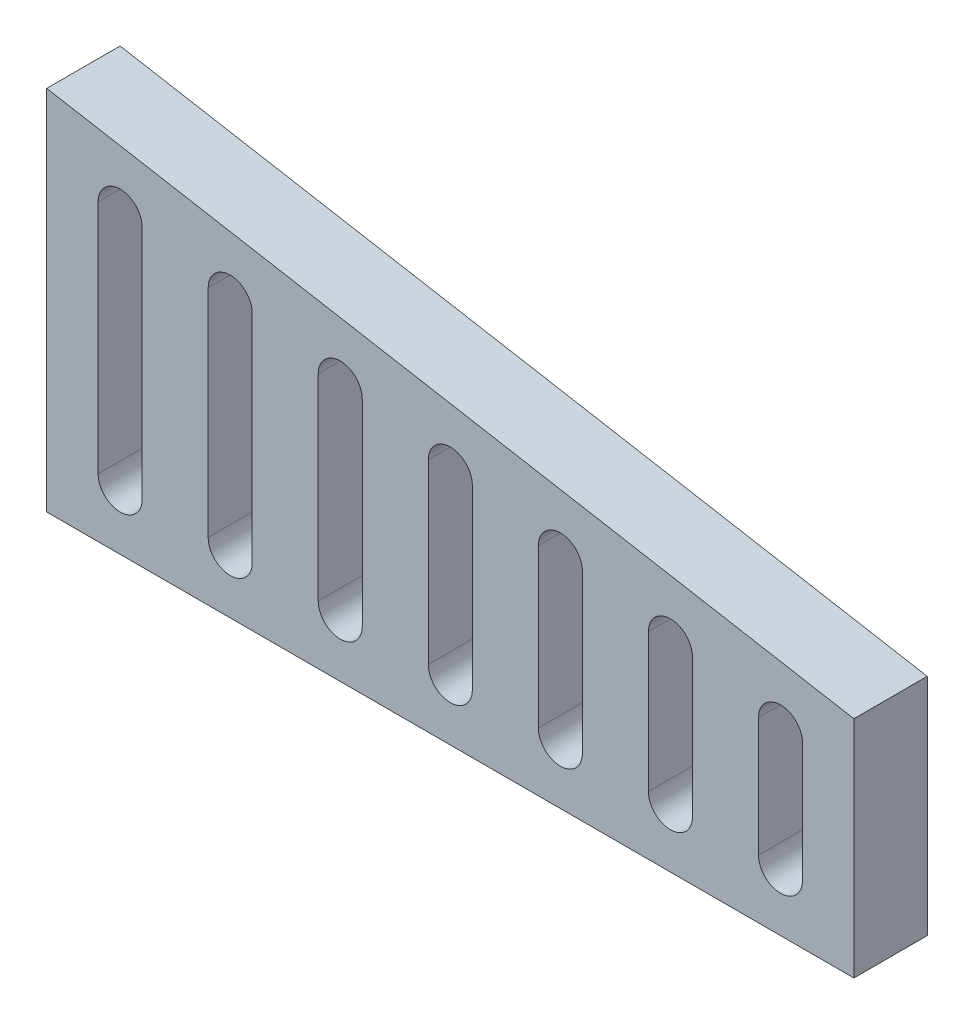
ISO-10303-21;
HEADER;
FILE_DESCRIPTION(('STEP AP214'),'2;1');
FILE_NAME('part.step','',(''),(''),'','','');
FILE_SCHEMA(('AUTOMOTIVE_DESIGN { 1 0 10303 214 1 1 1 1 }'));
ENDSEC;
DATA;
#1=APPLICATION_CONTEXT('core data for automotive mechanical design processes');
#2=APPLICATION_PROTOCOL_DEFINITION('international standard','automotive_design',2000,#1);
#3=PRODUCT_CONTEXT('',#1,'mechanical');
#4=PRODUCT('Part','Part','',(#3));
#5=PRODUCT_RELATED_PRODUCT_CATEGORY('part','',(#4));
#6=PRODUCT_DEFINITION_FORMATION('','',#4);
#7=PRODUCT_DEFINITION_CONTEXT('part definition',#1,'design');
#8=PRODUCT_DEFINITION('design','',#6,#7);
#9=PRODUCT_DEFINITION_SHAPE('','',#8);
#10=(LENGTH_UNIT() NAMED_UNIT(*) SI_UNIT(.MILLI.,.METRE.));
#11=(NAMED_UNIT(*) PLANE_ANGLE_UNIT() SI_UNIT($,.RADIAN.));
#12=(NAMED_UNIT(*) SI_UNIT($,.STERADIAN.) SOLID_ANGLE_UNIT());
#13=UNCERTAINTY_MEASURE_WITH_UNIT(LENGTH_MEASURE(1.E-05),#10,'distance_accuracy_value','');
#14=(GEOMETRIC_REPRESENTATION_CONTEXT(3) GLOBAL_UNCERTAINTY_ASSIGNED_CONTEXT((#13)) GLOBAL_UNIT_ASSIGNED_CONTEXT((#10,
#11,#12)) REPRESENTATION_CONTEXT('',''));
#15=CARTESIAN_POINT('',(0.,0.,0.));
#16=DIRECTION('',(0.,0.,1.));
#17=DIRECTION('',(1.,0.,0.));
#18=AXIS2_PLACEMENT_3D('',#15,#16,#17);
#19=CARTESIAN_POINT('',(110.,0.,5.));
#20=DIRECTION('',(0.,1.,0.));
#21=DIRECTION('',(0.,0.,1.));
#22=AXIS2_PLACEMENT_3D('',#19,#20,#21);
#23=PLANE('',#22);
#24=DIRECTION('',(1.,0.,0.));
#25=VECTOR('',#24,1.);
#26=CARTESIAN_POINT('',(110.,0.,-5.));
#27=LINE('',#26,#25);
#28=CARTESIAN_POINT('',(0.,0.,-5.));
#29=VERTEX_POINT('',#28);
#30=CARTESIAN_POINT('',(110.,0.,-5.));
#31=VERTEX_POINT('',#30);
#32=EDGE_CURVE('E469',#29,#31,#27,.T.);
#33=ORIENTED_EDGE('',*,*,#32,.T.);
#34=DIRECTION('',(0.,0.,-1.));
#35=VECTOR('',#34,1.);
#36=CARTESIAN_POINT('',(110.,0.,5.));
#37=LINE('',#36,#35);
#38=CARTESIAN_POINT('',(110.,0.,5.));
#39=VERTEX_POINT('',#38);
#40=EDGE_CURVE('E11',#39,#31,#37,.T.);
#41=ORIENTED_EDGE('',*,*,#40,.F.);
#42=DIRECTION('',(1.,0.,0.));
#43=VECTOR('',#42,1.);
#44=CARTESIAN_POINT('',(110.,0.,5.));
#45=LINE('',#44,#43);
#46=CARTESIAN_POINT('',(0.,0.,5.));
#47=VERTEX_POINT('',#46);
#48=EDGE_CURVE('E470',#47,#39,#45,.T.);
#49=ORIENTED_EDGE('',*,*,#48,.F.);
#50=DIRECTION('',(0.,0.,-1.));
#51=VECTOR('',#50,1.);
#52=CARTESIAN_POINT('',(0.,0.,5.));
#53=LINE('',#52,#51);
#54=EDGE_CURVE('E480',#47,#29,#53,.T.);
#55=ORIENTED_EDGE('',*,*,#54,.T.);
#56=EDGE_LOOP('',(#33,#41,#49,#55));
#57=FACE_BOUND('',#56,.T.);
#58=ADVANCED_FACE('F35',(#57),#23,.F.);
#59=CARTESIAN_POINT('',(110.,30.6040321220697,5.));
#60=DIRECTION('',(-1.,0.,0.));
#61=DIRECTION('',(0.,0.,1.));
#62=AXIS2_PLACEMENT_3D('',#59,#60,#61);
#63=PLANE('',#62);
#64=DIRECTION('',(0.,1.,0.));
#65=VECTOR('',#64,1.);
#66=CARTESIAN_POINT('',(110.,30.6040321220697,-5.));
#67=LINE('',#66,#65);
#68=CARTESIAN_POINT('',(110.,30.6040321220697,-5.));
#69=VERTEX_POINT('',#68);
#70=EDGE_CURVE('E483',#31,#69,#67,.T.);
#71=ORIENTED_EDGE('',*,*,#70,.T.);
#72=DIRECTION('',(0.,0.,-1.));
#73=VECTOR('',#72,1.);
#74=CARTESIAN_POINT('',(110.,30.6040321220697,5.));
#75=LINE('',#74,#73);
#76=CARTESIAN_POINT('',(110.,30.6040321220697,5.));
#77=VERTEX_POINT('',#76);
#78=EDGE_CURVE('E42',#77,#69,#75,.T.);
#79=ORIENTED_EDGE('',*,*,#78,.F.);
#80=DIRECTION('',(0.,1.,0.));
#81=VECTOR('',#80,1.);
#82=CARTESIAN_POINT('',(110.,30.6040321220697,5.));
#83=LINE('',#82,#81);
#84=EDGE_CURVE('E473',#39,#77,#83,.T.);
#85=ORIENTED_EDGE('',*,*,#84,.F.);
#86=ORIENTED_EDGE('',*,*,#40,.T.);
#87=EDGE_LOOP('',(#71,#79,#85,#86));
#88=FACE_BOUND('',#87,.T.);
#89=ADVANCED_FACE('F512',(#88),#63,.F.);
#90=CARTESIAN_POINT('',(0.,50.,5.));
#91=DIRECTION('',(-0.173648177666923,-0.984807753012209,0.));
#92=DIRECTION('',(0.984807753012209,-0.173648177666923,0.));
#93=AXIS2_PLACEMENT_3D('',#90,#91,#92);
#94=PLANE('',#93);
#95=DIRECTION('',(-0.984807753012209,0.173648177666923,0.));
#96=VECTOR('',#95,1.);
#97=CARTESIAN_POINT('',(0.,50.,-5.));
#98=LINE('',#97,#96);
#99=CARTESIAN_POINT('',(0.,50.,-5.));
#100=VERTEX_POINT('',#99);
#101=EDGE_CURVE('E485',#69,#100,#98,.T.);
#102=ORIENTED_EDGE('',*,*,#101,.T.);
#103=DIRECTION('',(0.,0.,-1.));
#104=VECTOR('',#103,1.);
#105=CARTESIAN_POINT('',(0.,50.,5.));
#106=LINE('',#105,#104);
#107=CARTESIAN_POINT('',(0.,50.,5.));
#108=VERTEX_POINT('',#107);
#109=EDGE_CURVE('E490',#108,#100,#106,.T.);
#110=ORIENTED_EDGE('',*,*,#109,.F.);
#111=DIRECTION('',(-0.984807753012209,0.173648177666923,0.));
#112=VECTOR('',#111,1.);
#113=CARTESIAN_POINT('',(0.,50.,5.));
#114=LINE('',#113,#112);
#115=EDGE_CURVE('E476',#77,#108,#114,.T.);
#116=ORIENTED_EDGE('',*,*,#115,.F.);
#117=ORIENTED_EDGE('',*,*,#78,.T.);
#118=EDGE_LOOP('',(#102,#110,#116,#117));
#119=FACE_BOUND('',#118,.T.);
#120=ADVANCED_FACE('F497',(#119),#94,.F.);
#121=CARTESIAN_POINT('',(0.,0.,5.));
#122=DIRECTION('',(1.,0.,0.));
#123=DIRECTION('',(0.,0.,-1.));
#124=AXIS2_PLACEMENT_3D('',#121,#122,#123);
#125=PLANE('',#124);
#126=DIRECTION('',(0.,-1.,0.));
#127=VECTOR('',#126,1.);
#128=CARTESIAN_POINT('',(0.,0.,-5.));
#129=LINE('',#128,#127);
#130=EDGE_CURVE('E474',#100,#29,#129,.T.);
#131=ORIENTED_EDGE('',*,*,#130,.T.);
#132=ORIENTED_EDGE('',*,*,#54,.F.);
#133=DIRECTION('',(0.,-1.,0.));
#134=VECTOR('',#133,1.);
#135=CARTESIAN_POINT('',(0.,0.,5.));
#136=LINE('',#135,#134);
#137=EDGE_CURVE('E478',#108,#47,#136,.T.);
#138=ORIENTED_EDGE('',*,*,#137,.F.);
#139=ORIENTED_EDGE('',*,*,#109,.T.);
#140=EDGE_LOOP('',(#131,#132,#138,#139));
#141=FACE_BOUND('',#140,.T.);
#142=ADVANCED_FACE('F505',(#141),#125,.F.);
#143=CARTESIAN_POINT('',(0.,0.,5.));
#144=DIRECTION('',(0.,0.,-1.));
#145=DIRECTION('',(-1.,0.,0.));
#146=AXIS2_PLACEMENT_3D('',#143,#144,#145);
#147=PLANE('',#146);
#148=DIRECTION('',(0.,-1.,0.));
#149=VECTOR('',#148,1.);
#150=CARTESIAN_POINT('',(97.,24.2438890340683,5.));
#151=LINE('',#150,#149);
#152=CARTESIAN_POINT('',(97.,24.2438890340683,5.));
#153=VERTEX_POINT('',#152);
#154=CARTESIAN_POINT('',(97.,8.,5.));
#155=VERTEX_POINT('',#154);
#156=EDGE_CURVE('E262',#153,#155,#151,.T.);
#157=ORIENTED_EDGE('',*,*,#156,.F.);
#158=CARTESIAN_POINT('',(100.,24.2438890340683,5.));
#159=DIRECTION('',(0.,0.,1.));
#160=DIRECTION('',(1.,0.,0.));
#161=AXIS2_PLACEMENT_3D('',#158,#159,#160);
#162=CIRCLE('',#161,3.00000000000002);
#163=CARTESIAN_POINT('',(103.,24.2438890340683,5.));
#164=VERTEX_POINT('',#163);
#165=EDGE_CURVE('E49',#164,#153,#162,.T.);
#166=ORIENTED_EDGE('',*,*,#165,.F.);
#167=DIRECTION('',(0.,1.,0.));
#168=VECTOR('',#167,1.);
#169=CARTESIAN_POINT('',(103.,24.2438890340683,5.));
#170=LINE('',#169,#168);
#171=CARTESIAN_POINT('',(103.,8.,5.));
#172=VERTEX_POINT('',#171);
#173=EDGE_CURVE('E255',#172,#164,#170,.T.);
#174=ORIENTED_EDGE('',*,*,#173,.F.);
#175=CARTESIAN_POINT('',(100.,8.,5.));
#176=DIRECTION('',(0.,0.,1.));
#177=DIRECTION('',(1.,0.,0.));
#178=AXIS2_PLACEMENT_3D('',#175,#176,#177);
#179=CIRCLE('',#178,3.00000000000002);
#180=EDGE_CURVE('E269',#155,#172,#179,.T.);
#181=ORIENTED_EDGE('',*,*,#180,.F.);
#182=EDGE_LOOP('',(#157,#166,#174,#181));
#183=FACE_BOUND('',#182,.T.);
#184=DIRECTION('',(0.,-1.,0.));
#185=VECTOR('',#184,1.);
#186=CARTESIAN_POINT('',(82.,26.8887937446952,5.));
#187=LINE('',#186,#185);
#188=CARTESIAN_POINT('',(82.,26.8887937446952,5.));
#189=VERTEX_POINT('',#188);
#190=CARTESIAN_POINT('',(82.,8.,5.));
#191=VERTEX_POINT('',#190);
#192=EDGE_CURVE('E288',#189,#191,#187,.T.);
#193=ORIENTED_EDGE('',*,*,#192,.F.);
#194=CARTESIAN_POINT('',(85.,26.8887937446952,5.));
#195=DIRECTION('',(0.,0.,1.));
#196=DIRECTION('',(1.,0.,0.));
#197=AXIS2_PLACEMENT_3D('',#194,#195,#196);
#198=CIRCLE('',#197,3.);
#199=CARTESIAN_POINT('',(88.,26.8887937446952,5.));
#200=VERTEX_POINT('',#199);
#201=EDGE_CURVE('E286',#200,#189,#198,.T.);
#202=ORIENTED_EDGE('',*,*,#201,.F.);
#203=DIRECTION('',(0.,1.,0.));
#204=VECTOR('',#203,1.);
#205=CARTESIAN_POINT('',(88.,26.8887937446952,5.));
#206=LINE('',#205,#204);
#207=CARTESIAN_POINT('',(88.,8.,5.));
#208=VERTEX_POINT('',#207);
#209=EDGE_CURVE('E294',#208,#200,#206,.T.);
#210=ORIENTED_EDGE('',*,*,#209,.F.);
#211=CARTESIAN_POINT('',(85.,8.,5.));
#212=DIRECTION('',(0.,0.,1.));
#213=DIRECTION('',(1.,0.,0.));
#214=AXIS2_PLACEMENT_3D('',#211,#212,#213);
#215=CIRCLE('',#214,3.);
#216=EDGE_CURVE('E291',#191,#208,#215,.T.);
#217=ORIENTED_EDGE('',*,*,#216,.F.);
#218=EDGE_LOOP('',(#193,#202,#210,#217));
#219=FACE_BOUND('',#218,.T.);
#220=DIRECTION('',(0.,-1.,0.));
#221=VECTOR('',#220,1.);
#222=CARTESIAN_POINT('',(67.,29.533698455322,5.));
#223=LINE('',#222,#221);
#224=CARTESIAN_POINT('',(67.,29.533698455322,5.));
#225=VERTEX_POINT('',#224);
#226=CARTESIAN_POINT('',(67.,8.,5.));
#227=VERTEX_POINT('',#226);
#228=EDGE_CURVE('E320',#225,#227,#223,.T.);
#229=ORIENTED_EDGE('',*,*,#228,.F.);
#230=CARTESIAN_POINT('',(70.,29.533698455322,5.));
#231=DIRECTION('',(0.,0.,1.));
#232=DIRECTION('',(1.,0.,0.));
#233=AXIS2_PLACEMENT_3D('',#230,#231,#232);
#234=CIRCLE('',#233,3.00000000000002);
#235=CARTESIAN_POINT('',(73.,29.533698455322,5.));
#236=VERTEX_POINT('',#235);
#237=EDGE_CURVE('E318',#236,#225,#234,.T.);
#238=ORIENTED_EDGE('',*,*,#237,.F.);
#239=DIRECTION('',(0.,1.,0.));
#240=VECTOR('',#239,1.);
#241=CARTESIAN_POINT('',(73.,29.533698455322,5.));
#242=LINE('',#241,#240);
#243=CARTESIAN_POINT('',(73.,8.,5.));
#244=VERTEX_POINT('',#243);
#245=EDGE_CURVE('E326',#244,#236,#242,.T.);
#246=ORIENTED_EDGE('',*,*,#245,.F.);
#247=CARTESIAN_POINT('',(70.,8.,5.));
#248=DIRECTION('',(0.,0.,1.));
#249=DIRECTION('',(1.,0.,0.));
#250=AXIS2_PLACEMENT_3D('',#247,#248,#249);
#251=CIRCLE('',#250,3.00000000000002);
#252=EDGE_CURVE('E323',#227,#244,#251,.T.);
#253=ORIENTED_EDGE('',*,*,#252,.F.);
#254=EDGE_LOOP('',(#229,#238,#246,#253));
#255=FACE_BOUND('',#254,.T.);
#256=DIRECTION('',(0.,-1.,0.));
#257=VECTOR('',#256,1.);
#258=CARTESIAN_POINT('',(52.,32.1786031659489,5.));
#259=LINE('',#258,#257);
#260=CARTESIAN_POINT('',(52.,32.1786031659489,5.));
#261=VERTEX_POINT('',#260);
#262=CARTESIAN_POINT('',(52.,8.,5.));
#263=VERTEX_POINT('',#262);
#264=EDGE_CURVE('E352',#261,#263,#259,.T.);
#265=ORIENTED_EDGE('',*,*,#264,.F.);
#266=CARTESIAN_POINT('',(55.,32.1786031659489,5.));
#267=DIRECTION('',(0.,0.,1.));
#268=DIRECTION('',(1.,0.,0.));
#269=AXIS2_PLACEMENT_3D('',#266,#267,#268);
#270=CIRCLE('',#269,3.);
#271=CARTESIAN_POINT('',(58.,32.1786031659489,5.));
#272=VERTEX_POINT('',#271);
#273=EDGE_CURVE('E350',#272,#261,#270,.T.);
#274=ORIENTED_EDGE('',*,*,#273,.F.);
#275=DIRECTION('',(0.,1.,0.));
#276=VECTOR('',#275,1.);
#277=CARTESIAN_POINT('',(58.,32.1786031659489,5.));
#278=LINE('',#277,#276);
#279=CARTESIAN_POINT('',(58.,8.,5.));
#280=VERTEX_POINT('',#279);
#281=EDGE_CURVE('E358',#280,#272,#278,.T.);
#282=ORIENTED_EDGE('',*,*,#281,.F.);
#283=CARTESIAN_POINT('',(55.,8.,5.));
#284=DIRECTION('',(0.,0.,1.));
#285=DIRECTION('',(1.,0.,0.));
#286=AXIS2_PLACEMENT_3D('',#283,#284,#285);
#287=CIRCLE('',#286,3.);
#288=EDGE_CURVE('E355',#263,#280,#287,.T.);
#289=ORIENTED_EDGE('',*,*,#288,.F.);
#290=EDGE_LOOP('',(#265,#274,#282,#289));
#291=FACE_BOUND('',#290,.T.);
#292=DIRECTION('',(0.,-1.,0.));
#293=VECTOR('',#292,1.);
#294=CARTESIAN_POINT('',(37.,34.8235078765758,5.));
#295=LINE('',#294,#293);
#296=CARTESIAN_POINT('',(37.,34.8235078765758,5.));
#297=VERTEX_POINT('',#296);
#298=CARTESIAN_POINT('',(37.,8.,5.));
#299=VERTEX_POINT('',#298);
#300=EDGE_CURVE('E384',#297,#299,#295,.T.);
#301=ORIENTED_EDGE('',*,*,#300,.F.);
#302=CARTESIAN_POINT('',(40.,34.8235078765758,5.));
#303=DIRECTION('',(0.,0.,1.));
#304=DIRECTION('',(1.,0.,0.));
#305=AXIS2_PLACEMENT_3D('',#302,#303,#304);
#306=CIRCLE('',#305,3.);
#307=CARTESIAN_POINT('',(43.,34.8235078765758,5.));
#308=VERTEX_POINT('',#307);
#309=EDGE_CURVE('E382',#308,#297,#306,.T.);
#310=ORIENTED_EDGE('',*,*,#309,.F.);
#311=DIRECTION('',(0.,1.,0.));
#312=VECTOR('',#311,1.);
#313=CARTESIAN_POINT('',(43.,34.8235078765758,5.));
#314=LINE('',#313,#312);
#315=CARTESIAN_POINT('',(43.,8.,5.));
#316=VERTEX_POINT('',#315);
#317=EDGE_CURVE('E390',#316,#308,#314,.T.);
#318=ORIENTED_EDGE('',*,*,#317,.F.);
#319=CARTESIAN_POINT('',(40.,8.,5.));
#320=DIRECTION('',(0.,0.,1.));
#321=DIRECTION('',(1.,0.,0.));
#322=AXIS2_PLACEMENT_3D('',#319,#320,#321);
#323=CIRCLE('',#322,3.00000000000001);
#324=EDGE_CURVE('E387',#299,#316,#323,.T.);
#325=ORIENTED_EDGE('',*,*,#324,.F.);
#326=EDGE_LOOP('',(#301,#310,#318,#325));
#327=FACE_BOUND('',#326,.T.);
#328=DIRECTION('',(0.,-1.,0.));
#329=VECTOR('',#328,1.);
#330=CARTESIAN_POINT('',(22.,37.4684125872026,5.));
#331=LINE('',#330,#329);
#332=CARTESIAN_POINT('',(22.,37.4684125872026,5.));
#333=VERTEX_POINT('',#332);
#334=CARTESIAN_POINT('',(22.,8.,5.));
#335=VERTEX_POINT('',#334);
#336=EDGE_CURVE('E416',#333,#335,#331,.T.);
#337=ORIENTED_EDGE('',*,*,#336,.F.);
#338=CARTESIAN_POINT('',(25.,37.4684125872026,5.));
#339=DIRECTION('',(0.,0.,1.));
#340=DIRECTION('',(1.,0.,0.));
#341=AXIS2_PLACEMENT_3D('',#338,#339,#340);
#342=CIRCLE('',#341,2.99999999999999);
#343=CARTESIAN_POINT('',(28.,37.4684125872026,5.));
#344=VERTEX_POINT('',#343);
#345=EDGE_CURVE('E414',#344,#333,#342,.T.);
#346=ORIENTED_EDGE('',*,*,#345,.F.);
#347=DIRECTION('',(0.,1.,0.));
#348=VECTOR('',#347,1.);
#349=CARTESIAN_POINT('',(28.,37.4684125872026,5.));
#350=LINE('',#349,#348);
#351=CARTESIAN_POINT('',(28.,8.,5.));
#352=VERTEX_POINT('',#351);
#353=EDGE_CURVE('E422',#352,#344,#350,.T.);
#354=ORIENTED_EDGE('',*,*,#353,.F.);
#355=CARTESIAN_POINT('',(25.,8.,5.));
#356=DIRECTION('',(0.,0.,1.));
#357=DIRECTION('',(1.,0.,0.));
#358=AXIS2_PLACEMENT_3D('',#355,#356,#357);
#359=CIRCLE('',#358,3.);
#360=EDGE_CURVE('E419',#335,#352,#359,.T.);
#361=ORIENTED_EDGE('',*,*,#360,.F.);
#362=EDGE_LOOP('',(#337,#346,#354,#361));
#363=FACE_BOUND('',#362,.T.);
#364=DIRECTION('',(0.,-1.,0.));
#365=VECTOR('',#364,1.);
#366=CARTESIAN_POINT('',(7.,40.1133172978295,5.));
#367=LINE('',#366,#365);
#368=CARTESIAN_POINT('',(7.,40.1133172978295,5.));
#369=VERTEX_POINT('',#368);
#370=CARTESIAN_POINT('',(7.,8.,5.));
#371=VERTEX_POINT('',#370);
#372=EDGE_CURVE('E448',#369,#371,#367,.T.);
#373=ORIENTED_EDGE('',*,*,#372,.F.);
#374=CARTESIAN_POINT('',(10.,40.1133172978295,5.));
#375=DIRECTION('',(0.,0.,1.));
#376=DIRECTION('',(1.,0.,0.));
#377=AXIS2_PLACEMENT_3D('',#374,#375,#376);
#378=CIRCLE('',#377,3.);
#379=CARTESIAN_POINT('',(13.,40.1133172978295,5.));
#380=VERTEX_POINT('',#379);
#381=EDGE_CURVE('E446',#380,#369,#378,.T.);
#382=ORIENTED_EDGE('',*,*,#381,.F.);
#383=DIRECTION('',(0.,1.,0.));
#384=VECTOR('',#383,1.);
#385=CARTESIAN_POINT('',(13.,40.1133172978295,5.));
#386=LINE('',#385,#384);
#387=CARTESIAN_POINT('',(13.,8.,5.));
#388=VERTEX_POINT('',#387);
#389=EDGE_CURVE('E454',#388,#380,#386,.T.);
#390=ORIENTED_EDGE('',*,*,#389,.F.);
#391=CARTESIAN_POINT('',(10.,8.,5.));
#392=DIRECTION('',(0.,0.,1.));
#393=DIRECTION('',(1.,0.,0.));
#394=AXIS2_PLACEMENT_3D('',#391,#392,#393);
#395=CIRCLE('',#394,3.);
#396=EDGE_CURVE('E451',#371,#388,#395,.T.);
#397=ORIENTED_EDGE('',*,*,#396,.F.);
#398=EDGE_LOOP('',(#373,#382,#390,#397));
#399=FACE_BOUND('',#398,.T.);
#400=ORIENTED_EDGE('',*,*,#48,.T.);
#401=ORIENTED_EDGE('',*,*,#84,.T.);
#402=ORIENTED_EDGE('',*,*,#115,.T.);
#403=ORIENTED_EDGE('',*,*,#137,.T.);
#404=EDGE_LOOP('',(#400,#401,#402,#403));
#405=FACE_BOUND('',#404,.T.);
#406=ADVANCED_FACE('F511',(#183,#219,#255,#291,#327,#363,#399,#405),#147,.F.);
#407=CARTESIAN_POINT('',(0.,0.,-5.));
#408=DIRECTION('',(0.,0.,-1.));
#409=DIRECTION('',(-1.,0.,0.));
#410=AXIS2_PLACEMENT_3D('',#407,#408,#409);
#411=PLANE('',#410);
#412=CARTESIAN_POINT('',(100.,24.2438890340683,-5.));
#413=DIRECTION('',(0.,0.,-1.));
#414=DIRECTION('',(-1.,0.,0.));
#415=AXIS2_PLACEMENT_3D('',#412,#413,#414);
#416=CIRCLE('',#415,3.00000000000002);
#417=CARTESIAN_POINT('',(103.,24.2438890340683,-5.));
#418=VERTEX_POINT('',#417);
#419=CARTESIAN_POINT('',(97.,24.2438890340683,-5.));
#420=VERTEX_POINT('',#419);
#421=EDGE_CURVE('E253',#418,#420,#416,.F.);
#422=ORIENTED_EDGE('',*,*,#421,.T.);
#423=DIRECTION('',(0.,-1.,0.));
#424=VECTOR('',#423,1.);
#425=CARTESIAN_POINT('',(97.,24.2438890340683,-5.));
#426=LINE('',#425,#424);
#427=CARTESIAN_POINT('',(97.,8.,-5.));
#428=VERTEX_POINT('',#427);
#429=EDGE_CURVE('E242',#420,#428,#426,.T.);
#430=ORIENTED_EDGE('',*,*,#429,.T.);
#431=CARTESIAN_POINT('',(100.,8.,-5.));
#432=DIRECTION('',(0.,0.,-1.));
#433=DIRECTION('',(-1.,0.,0.));
#434=AXIS2_PLACEMENT_3D('',#431,#432,#433);
#435=CIRCLE('',#434,3.00000000000002);
#436=CARTESIAN_POINT('',(103.,8.,-5.));
#437=VERTEX_POINT('',#436);
#438=EDGE_CURVE('E264',#428,#437,#435,.F.);
#439=ORIENTED_EDGE('',*,*,#438,.T.);
#440=DIRECTION('',(0.,1.,0.));
#441=VECTOR('',#440,1.);
#442=CARTESIAN_POINT('',(103.,24.2438890340683,-5.));
#443=LINE('',#442,#441);
#444=EDGE_CURVE('E260',#437,#418,#443,.T.);
#445=ORIENTED_EDGE('',*,*,#444,.T.);
#446=EDGE_LOOP('',(#422,#430,#439,#445));
#447=FACE_BOUND('',#446,.T.);
#448=CARTESIAN_POINT('',(85.,26.8887937446952,-5.));
#449=DIRECTION('',(0.,0.,-1.));
#450=DIRECTION('',(-1.,0.,0.));
#451=AXIS2_PLACEMENT_3D('',#448,#449,#450);
#452=CIRCLE('',#451,3.);
#453=CARTESIAN_POINT('',(88.,26.8887937446952,-5.));
#454=VERTEX_POINT('',#453);
#455=CARTESIAN_POINT('',(82.,26.8887937446952,-5.));
#456=VERTEX_POINT('',#455);
#457=EDGE_CURVE('E283',#454,#456,#452,.F.);
#458=ORIENTED_EDGE('',*,*,#457,.T.);
#459=DIRECTION('',(0.,-1.,0.));
#460=VECTOR('',#459,1.);
#461=CARTESIAN_POINT('',(82.,26.8887937446952,-5.));
#462=LINE('',#461,#460);
#463=CARTESIAN_POINT('',(82.,8.,-5.));
#464=VERTEX_POINT('',#463);
#465=EDGE_CURVE('E300',#456,#464,#462,.T.);
#466=ORIENTED_EDGE('',*,*,#465,.T.);
#467=CARTESIAN_POINT('',(85.,8.,-5.));
#468=DIRECTION('',(0.,0.,-1.));
#469=DIRECTION('',(-1.,0.,0.));
#470=AXIS2_PLACEMENT_3D('',#467,#468,#469);
#471=CIRCLE('',#470,3.);
#472=CARTESIAN_POINT('',(88.,8.,-5.));
#473=VERTEX_POINT('',#472);
#474=EDGE_CURVE('E249',#464,#473,#471,.F.);
#475=ORIENTED_EDGE('',*,*,#474,.T.);
#476=DIRECTION('',(0.,1.,0.));
#477=VECTOR('',#476,1.);
#478=CARTESIAN_POINT('',(88.,26.8887937446952,-5.));
#479=LINE('',#478,#477);
#480=EDGE_CURVE('E280',#473,#454,#479,.T.);
#481=ORIENTED_EDGE('',*,*,#480,.T.);
#482=EDGE_LOOP('',(#458,#466,#475,#481));
#483=FACE_BOUND('',#482,.T.);
#484=CARTESIAN_POINT('',(70.,29.533698455322,-5.));
#485=DIRECTION('',(0.,0.,-1.));
#486=DIRECTION('',(-1.,0.,0.));
#487=AXIS2_PLACEMENT_3D('',#484,#485,#486);
#488=CIRCLE('',#487,3.00000000000002);
#489=CARTESIAN_POINT('',(73.,29.533698455322,-5.));
#490=VERTEX_POINT('',#489);
#491=CARTESIAN_POINT('',(67.,29.533698455322,-5.));
#492=VERTEX_POINT('',#491);
#493=EDGE_CURVE('E315',#490,#492,#488,.F.);
#494=ORIENTED_EDGE('',*,*,#493,.T.);
#495=DIRECTION('',(0.,-1.,0.));
#496=VECTOR('',#495,1.);
#497=CARTESIAN_POINT('',(67.,29.533698455322,-5.));
#498=LINE('',#497,#496);
#499=CARTESIAN_POINT('',(67.,8.,-5.));
#500=VERTEX_POINT('',#499);
#501=EDGE_CURVE('E332',#492,#500,#498,.T.);
#502=ORIENTED_EDGE('',*,*,#501,.T.);
#503=CARTESIAN_POINT('',(70.,8.,-5.));
#504=DIRECTION('',(0.,0.,-1.));
#505=DIRECTION('',(-1.,0.,0.));
#506=AXIS2_PLACEMENT_3D('',#503,#504,#505);
#507=CIRCLE('',#506,3.00000000000002);
#508=CARTESIAN_POINT('',(73.,8.,-5.));
#509=VERTEX_POINT('',#508);
#510=EDGE_CURVE('E309',#500,#509,#507,.F.);
#511=ORIENTED_EDGE('',*,*,#510,.T.);
#512=DIRECTION('',(0.,1.,0.));
#513=VECTOR('',#512,1.);
#514=CARTESIAN_POINT('',(73.,29.533698455322,-5.));
#515=LINE('',#514,#513);
#516=EDGE_CURVE('E312',#509,#490,#515,.T.);
#517=ORIENTED_EDGE('',*,*,#516,.T.);
#518=EDGE_LOOP('',(#494,#502,#511,#517));
#519=FACE_BOUND('',#518,.T.);
#520=CARTESIAN_POINT('',(55.,32.1786031659489,-5.));
#521=DIRECTION('',(0.,0.,-1.));
#522=DIRECTION('',(-1.,0.,0.));
#523=AXIS2_PLACEMENT_3D('',#520,#521,#522);
#524=CIRCLE('',#523,3.);
#525=CARTESIAN_POINT('',(58.,32.1786031659489,-5.));
#526=VERTEX_POINT('',#525);
#527=CARTESIAN_POINT('',(52.,32.1786031659489,-5.));
#528=VERTEX_POINT('',#527);
#529=EDGE_CURVE('E347',#526,#528,#524,.F.);
#530=ORIENTED_EDGE('',*,*,#529,.T.);
#531=DIRECTION('',(0.,-1.,0.));
#532=VECTOR('',#531,1.);
#533=CARTESIAN_POINT('',(52.,32.1786031659489,-5.));
#534=LINE('',#533,#532);
#535=CARTESIAN_POINT('',(52.,8.,-5.));
#536=VERTEX_POINT('',#535);
#537=EDGE_CURVE('E364',#528,#536,#534,.T.);
#538=ORIENTED_EDGE('',*,*,#537,.T.);
#539=CARTESIAN_POINT('',(55.,8.,-5.));
#540=DIRECTION('',(0.,0.,-1.));
#541=DIRECTION('',(-1.,0.,0.));
#542=AXIS2_PLACEMENT_3D('',#539,#540,#541);
#543=CIRCLE('',#542,3.);
#544=CARTESIAN_POINT('',(58.,8.,-5.));
#545=VERTEX_POINT('',#544);
#546=EDGE_CURVE('E341',#536,#545,#543,.F.);
#547=ORIENTED_EDGE('',*,*,#546,.T.);
#548=DIRECTION('',(0.,1.,0.));
#549=VECTOR('',#548,1.);
#550=CARTESIAN_POINT('',(58.,32.1786031659489,-5.));
#551=LINE('',#550,#549);
#552=EDGE_CURVE('E344',#545,#526,#551,.T.);
#553=ORIENTED_EDGE('',*,*,#552,.T.);
#554=EDGE_LOOP('',(#530,#538,#547,#553));
#555=FACE_BOUND('',#554,.T.);
#556=CARTESIAN_POINT('',(40.,34.8235078765758,-5.));
#557=DIRECTION('',(0.,0.,-1.));
#558=DIRECTION('',(-1.,0.,0.));
#559=AXIS2_PLACEMENT_3D('',#556,#557,#558);
#560=CIRCLE('',#559,3.);
#561=CARTESIAN_POINT('',(43.,34.8235078765758,-5.));
#562=VERTEX_POINT('',#561);
#563=CARTESIAN_POINT('',(37.,34.8235078765758,-5.));
#564=VERTEX_POINT('',#563);
#565=EDGE_CURVE('E379',#562,#564,#560,.F.);
#566=ORIENTED_EDGE('',*,*,#565,.T.);
#567=DIRECTION('',(0.,-1.,0.));
#568=VECTOR('',#567,1.);
#569=CARTESIAN_POINT('',(37.,34.8235078765758,-5.));
#570=LINE('',#569,#568);
#571=CARTESIAN_POINT('',(37.,8.,-5.));
#572=VERTEX_POINT('',#571);
#573=EDGE_CURVE('E396',#564,#572,#570,.T.);
#574=ORIENTED_EDGE('',*,*,#573,.T.);
#575=CARTESIAN_POINT('',(40.,8.,-5.));
#576=DIRECTION('',(0.,0.,-1.));
#577=DIRECTION('',(-1.,0.,0.));
#578=AXIS2_PLACEMENT_3D('',#575,#576,#577);
#579=CIRCLE('',#578,3.00000000000001);
#580=CARTESIAN_POINT('',(43.,8.,-5.));
#581=VERTEX_POINT('',#580);
#582=EDGE_CURVE('E373',#572,#581,#579,.F.);
#583=ORIENTED_EDGE('',*,*,#582,.T.);
#584=DIRECTION('',(0.,1.,0.));
#585=VECTOR('',#584,1.);
#586=CARTESIAN_POINT('',(43.,34.8235078765758,-5.));
#587=LINE('',#586,#585);
#588=EDGE_CURVE('E376',#581,#562,#587,.T.);
#589=ORIENTED_EDGE('',*,*,#588,.T.);
#590=EDGE_LOOP('',(#566,#574,#583,#589));
#591=FACE_BOUND('',#590,.T.);
#592=CARTESIAN_POINT('',(25.,37.4684125872026,-5.));
#593=DIRECTION('',(0.,0.,-1.));
#594=DIRECTION('',(-1.,0.,0.));
#595=AXIS2_PLACEMENT_3D('',#592,#593,#594);
#596=CIRCLE('',#595,2.99999999999999);
#597=CARTESIAN_POINT('',(28.,37.4684125872026,-5.));
#598=VERTEX_POINT('',#597);
#599=CARTESIAN_POINT('',(22.,37.4684125872026,-5.));
#600=VERTEX_POINT('',#599);
#601=EDGE_CURVE('E411',#598,#600,#596,.F.);
#602=ORIENTED_EDGE('',*,*,#601,.T.);
#603=DIRECTION('',(0.,-1.,0.));
#604=VECTOR('',#603,1.);
#605=CARTESIAN_POINT('',(22.,37.4684125872026,-5.));
#606=LINE('',#605,#604);
#607=CARTESIAN_POINT('',(22.,8.,-5.));
#608=VERTEX_POINT('',#607);
#609=EDGE_CURVE('E428',#600,#608,#606,.T.);
#610=ORIENTED_EDGE('',*,*,#609,.T.);
#611=CARTESIAN_POINT('',(25.,8.,-5.));
#612=DIRECTION('',(0.,0.,-1.));
#613=DIRECTION('',(-1.,0.,0.));
#614=AXIS2_PLACEMENT_3D('',#611,#612,#613);
#615=CIRCLE('',#614,3.);
#616=CARTESIAN_POINT('',(28.,8.,-5.));
#617=VERTEX_POINT('',#616);
#618=EDGE_CURVE('E405',#608,#617,#615,.F.);
#619=ORIENTED_EDGE('',*,*,#618,.T.);
#620=DIRECTION('',(0.,1.,0.));
#621=VECTOR('',#620,1.);
#622=CARTESIAN_POINT('',(28.,37.4684125872026,-5.));
#623=LINE('',#622,#621);
#624=EDGE_CURVE('E408',#617,#598,#623,.T.);
#625=ORIENTED_EDGE('',*,*,#624,.T.);
#626=EDGE_LOOP('',(#602,#610,#619,#625));
#627=FACE_BOUND('',#626,.T.);
#628=CARTESIAN_POINT('',(10.,40.1133172978295,-5.));
#629=DIRECTION('',(0.,0.,-1.));
#630=DIRECTION('',(-1.,0.,0.));
#631=AXIS2_PLACEMENT_3D('',#628,#629,#630);
#632=CIRCLE('',#631,3.);
#633=CARTESIAN_POINT('',(13.,40.1133172978295,-5.));
#634=VERTEX_POINT('',#633);
#635=CARTESIAN_POINT('',(7.,40.1133172978295,-5.));
#636=VERTEX_POINT('',#635);
#637=EDGE_CURVE('E443',#634,#636,#632,.F.);
#638=ORIENTED_EDGE('',*,*,#637,.T.);
#639=DIRECTION('',(0.,-1.,0.));
#640=VECTOR('',#639,1.);
#641=CARTESIAN_POINT('',(7.,40.1133172978295,-5.));
#642=LINE('',#641,#640);
#643=CARTESIAN_POINT('',(7.,8.,-5.));
#644=VERTEX_POINT('',#643);
#645=EDGE_CURVE('E460',#636,#644,#642,.T.);
#646=ORIENTED_EDGE('',*,*,#645,.T.);
#647=CARTESIAN_POINT('',(10.,8.,-5.));
#648=DIRECTION('',(0.,0.,-1.));
#649=DIRECTION('',(-1.,0.,0.));
#650=AXIS2_PLACEMENT_3D('',#647,#648,#649);
#651=CIRCLE('',#650,3.);
#652=CARTESIAN_POINT('',(13.,8.,-5.));
#653=VERTEX_POINT('',#652);
#654=EDGE_CURVE('E437',#644,#653,#651,.F.);
#655=ORIENTED_EDGE('',*,*,#654,.T.);
#656=DIRECTION('',(0.,1.,0.));
#657=VECTOR('',#656,1.);
#658=CARTESIAN_POINT('',(13.,40.1133172978295,-5.));
#659=LINE('',#658,#657);
#660=EDGE_CURVE('E440',#653,#634,#659,.T.);
#661=ORIENTED_EDGE('',*,*,#660,.T.);
#662=EDGE_LOOP('',(#638,#646,#655,#661));
#663=FACE_BOUND('',#662,.T.);
#664=ORIENTED_EDGE('',*,*,#32,.F.);
#665=ORIENTED_EDGE('',*,*,#130,.F.);
#666=ORIENTED_EDGE('',*,*,#101,.F.);
#667=ORIENTED_EDGE('',*,*,#70,.F.);
#668=EDGE_LOOP('',(#664,#665,#666,#667));
#669=FACE_BOUND('',#668,.T.);
#670=ADVANCED_FACE('F258',(#447,#483,#519,#555,#591,#627,#663,#669),#411,.T.);
#671=CARTESIAN_POINT('',(10.,40.1133172978295,-5.001));
#672=DIRECTION('',(0.,0.,1.));
#673=DIRECTION('',(1.,0.,0.));
#674=AXIS2_PLACEMENT_3D('',#671,#672,#673);
#675=CYLINDRICAL_SURFACE('',#674,3.);
#676=DIRECTION('',(0.,0.,1.));
#677=VECTOR('',#676,1.);
#678=CARTESIAN_POINT('',(13.,40.1133172978295,-5.001));
#679=LINE('',#678,#677);
#680=EDGE_CURVE('E458',#634,#380,#679,.T.);
#681=ORIENTED_EDGE('',*,*,#680,.T.);
#682=ORIENTED_EDGE('',*,*,#381,.T.);
#683=DIRECTION('',(0.,0.,1.));
#684=VECTOR('',#683,1.);
#685=CARTESIAN_POINT('',(7.,40.1133172978295,-5.001));
#686=LINE('',#685,#684);
#687=EDGE_CURVE('E457',#636,#369,#686,.T.);
#688=ORIENTED_EDGE('',*,*,#687,.F.);
#689=ORIENTED_EDGE('',*,*,#637,.F.);
#690=EDGE_LOOP('',(#681,#682,#688,#689));
#691=FACE_BOUND('',#690,.T.);
#692=ADVANCED_FACE('F524',(#691),#675,.F.);
#693=CARTESIAN_POINT('',(13.,40.1133172978295,-5.001));
#694=DIRECTION('',(1.,0.,0.));
#695=DIRECTION('',(0.,1.,0.));
#696=AXIS2_PLACEMENT_3D('',#693,#694,#695);
#697=PLANE('',#696);
#698=DIRECTION('',(0.,0.,1.));
#699=VECTOR('',#698,1.);
#700=CARTESIAN_POINT('',(13.,8.,-5.001));
#701=LINE('',#700,#699);
#702=EDGE_CURVE('E461',#653,#388,#701,.T.);
#703=ORIENTED_EDGE('',*,*,#702,.T.);
#704=ORIENTED_EDGE('',*,*,#389,.T.);
#705=ORIENTED_EDGE('',*,*,#680,.F.);
#706=ORIENTED_EDGE('',*,*,#660,.F.);
#707=EDGE_LOOP('',(#703,#704,#705,#706));
#708=FACE_BOUND('',#707,.T.);
#709=ADVANCED_FACE('F530',(#708),#697,.F.);
#710=CARTESIAN_POINT('',(10.,8.,-5.001));
#711=DIRECTION('',(0.,0.,1.));
#712=DIRECTION('',(1.,0.,0.));
#713=AXIS2_PLACEMENT_3D('',#710,#711,#712);
#714=CYLINDRICAL_SURFACE('',#713,3.);
#715=DIRECTION('',(0.,0.,1.));
#716=VECTOR('',#715,1.);
#717=CARTESIAN_POINT('',(7.,8.,-5.001));
#718=LINE('',#717,#716);
#719=EDGE_CURVE('E463',#644,#371,#718,.T.);
#720=ORIENTED_EDGE('',*,*,#719,.T.);
#721=ORIENTED_EDGE('',*,*,#396,.T.);
#722=ORIENTED_EDGE('',*,*,#702,.F.);
#723=ORIENTED_EDGE('',*,*,#654,.F.);
#724=EDGE_LOOP('',(#720,#721,#722,#723));
#725=FACE_BOUND('',#724,.T.);
#726=ADVANCED_FACE('F536',(#725),#714,.F.);
#727=CARTESIAN_POINT('',(7.,40.1133172978295,-5.001));
#728=DIRECTION('',(-1.,0.,0.));
#729=DIRECTION('',(0.,-1.,0.));
#730=AXIS2_PLACEMENT_3D('',#727,#728,#729);
#731=PLANE('',#730);
#732=ORIENTED_EDGE('',*,*,#687,.T.);
#733=ORIENTED_EDGE('',*,*,#372,.T.);
#734=ORIENTED_EDGE('',*,*,#719,.F.);
#735=ORIENTED_EDGE('',*,*,#645,.F.);
#736=EDGE_LOOP('',(#732,#733,#734,#735));
#737=FACE_BOUND('',#736,.T.);
#738=ADVANCED_FACE('F532',(#737),#731,.F.);
#739=CARTESIAN_POINT('',(25.,37.4684125872026,-5.001));
#740=DIRECTION('',(0.,0.,1.));
#741=DIRECTION('',(1.,0.,0.));
#742=AXIS2_PLACEMENT_3D('',#739,#740,#741);
#743=CYLINDRICAL_SURFACE('',#742,2.99999999999999);
#744=DIRECTION('',(0.,0.,1.));
#745=VECTOR('',#744,1.);
#746=CARTESIAN_POINT('',(28.,37.4684125872026,-5.001));
#747=LINE('',#746,#745);
#748=EDGE_CURVE('E426',#598,#344,#747,.T.);
#749=ORIENTED_EDGE('',*,*,#748,.T.);
#750=ORIENTED_EDGE('',*,*,#345,.T.);
#751=DIRECTION('',(0.,0.,1.));
#752=VECTOR('',#751,1.);
#753=CARTESIAN_POINT('',(22.,37.4684125872026,-5.001));
#754=LINE('',#753,#752);
#755=EDGE_CURVE('E425',#600,#333,#754,.T.);
#756=ORIENTED_EDGE('',*,*,#755,.F.);
#757=ORIENTED_EDGE('',*,*,#601,.F.);
#758=EDGE_LOOP('',(#749,#750,#756,#757));
#759=FACE_BOUND('',#758,.T.);
#760=ADVANCED_FACE('F535',(#759),#743,.F.);
#761=CARTESIAN_POINT('',(28.,37.4684125872026,-5.001));
#762=DIRECTION('',(1.,0.,0.));
#763=DIRECTION('',(0.,1.,0.));
#764=AXIS2_PLACEMENT_3D('',#761,#762,#763);
#765=PLANE('',#764);
#766=DIRECTION('',(0.,0.,1.));
#767=VECTOR('',#766,1.);
#768=CARTESIAN_POINT('',(28.,8.,-5.001));
#769=LINE('',#768,#767);
#770=EDGE_CURVE('E429',#617,#352,#769,.T.);
#771=ORIENTED_EDGE('',*,*,#770,.T.);
#772=ORIENTED_EDGE('',*,*,#353,.T.);
#773=ORIENTED_EDGE('',*,*,#748,.F.);
#774=ORIENTED_EDGE('',*,*,#624,.F.);
#775=EDGE_LOOP('',(#771,#772,#773,#774));
#776=FACE_BOUND('',#775,.T.);
#777=ADVANCED_FACE('F546',(#776),#765,.F.);
#778=CARTESIAN_POINT('',(25.,8.,-5.001));
#779=DIRECTION('',(0.,0.,1.));
#780=DIRECTION('',(1.,0.,0.));
#781=AXIS2_PLACEMENT_3D('',#778,#779,#780);
#782=CYLINDRICAL_SURFACE('',#781,3.);
#783=DIRECTION('',(0.,0.,1.));
#784=VECTOR('',#783,1.);
#785=CARTESIAN_POINT('',(22.,8.,-5.001));
#786=LINE('',#785,#784);
#787=EDGE_CURVE('E431',#608,#335,#786,.T.);
#788=ORIENTED_EDGE('',*,*,#787,.T.);
#789=ORIENTED_EDGE('',*,*,#360,.T.);
#790=ORIENTED_EDGE('',*,*,#770,.F.);
#791=ORIENTED_EDGE('',*,*,#618,.F.);
#792=EDGE_LOOP('',(#788,#789,#790,#791));
#793=FACE_BOUND('',#792,.T.);
#794=ADVANCED_FACE('F552',(#793),#782,.F.);
#795=CARTESIAN_POINT('',(22.,37.4684125872026,-5.001));
#796=DIRECTION('',(-1.,0.,0.));
#797=DIRECTION('',(0.,0.,1.));
#798=AXIS2_PLACEMENT_3D('',#795,#796,#797);
#799=PLANE('',#798);
#800=ORIENTED_EDGE('',*,*,#755,.T.);
#801=ORIENTED_EDGE('',*,*,#336,.T.);
#802=ORIENTED_EDGE('',*,*,#787,.F.);
#803=ORIENTED_EDGE('',*,*,#609,.F.);
#804=EDGE_LOOP('',(#800,#801,#802,#803));
#805=FACE_BOUND('',#804,.T.);
#806=ADVANCED_FACE('F548',(#805),#799,.F.);
#807=CARTESIAN_POINT('',(40.,34.8235078765758,-5.001));
#808=DIRECTION('',(0.,0.,1.));
#809=DIRECTION('',(1.,0.,0.));
#810=AXIS2_PLACEMENT_3D('',#807,#808,#809);
#811=CYLINDRICAL_SURFACE('',#810,3.);
#812=DIRECTION('',(0.,0.,1.));
#813=VECTOR('',#812,1.);
#814=CARTESIAN_POINT('',(43.,34.8235078765758,-5.001));
#815=LINE('',#814,#813);
#816=EDGE_CURVE('E394',#562,#308,#815,.T.);
#817=ORIENTED_EDGE('',*,*,#816,.T.);
#818=ORIENTED_EDGE('',*,*,#309,.T.);
#819=DIRECTION('',(0.,0.,1.));
#820=VECTOR('',#819,1.);
#821=CARTESIAN_POINT('',(37.,34.8235078765758,-5.001));
#822=LINE('',#821,#820);
#823=EDGE_CURVE('E393',#564,#297,#822,.T.);
#824=ORIENTED_EDGE('',*,*,#823,.F.);
#825=ORIENTED_EDGE('',*,*,#565,.F.);
#826=EDGE_LOOP('',(#817,#818,#824,#825));
#827=FACE_BOUND('',#826,.T.);
#828=ADVANCED_FACE('F551',(#827),#811,.F.);
#829=CARTESIAN_POINT('',(43.,34.8235078765758,-5.001));
#830=DIRECTION('',(1.,0.,0.));
#831=DIRECTION('',(0.,1.,0.));
#832=AXIS2_PLACEMENT_3D('',#829,#830,#831);
#833=PLANE('',#832);
#834=DIRECTION('',(0.,0.,1.));
#835=VECTOR('',#834,1.);
#836=CARTESIAN_POINT('',(43.,8.,-5.001));
#837=LINE('',#836,#835);
#838=EDGE_CURVE('E397',#581,#316,#837,.T.);
#839=ORIENTED_EDGE('',*,*,#838,.T.);
#840=ORIENTED_EDGE('',*,*,#317,.T.);
#841=ORIENTED_EDGE('',*,*,#816,.F.);
#842=ORIENTED_EDGE('',*,*,#588,.F.);
#843=EDGE_LOOP('',(#839,#840,#841,#842));
#844=FACE_BOUND('',#843,.T.);
#845=ADVANCED_FACE('F562',(#844),#833,.F.);
#846=CARTESIAN_POINT('',(40.,8.,-5.001));
#847=DIRECTION('',(0.,0.,1.));
#848=DIRECTION('',(1.,0.,0.));
#849=AXIS2_PLACEMENT_3D('',#846,#847,#848);
#850=CYLINDRICAL_SURFACE('',#849,3.00000000000001);
#851=DIRECTION('',(0.,0.,1.));
#852=VECTOR('',#851,1.);
#853=CARTESIAN_POINT('',(37.,8.,-5.001));
#854=LINE('',#853,#852);
#855=EDGE_CURVE('E399',#572,#299,#854,.T.);
#856=ORIENTED_EDGE('',*,*,#855,.T.);
#857=ORIENTED_EDGE('',*,*,#324,.T.);
#858=ORIENTED_EDGE('',*,*,#838,.F.);
#859=ORIENTED_EDGE('',*,*,#582,.F.);
#860=EDGE_LOOP('',(#856,#857,#858,#859));
#861=FACE_BOUND('',#860,.T.);
#862=ADVANCED_FACE('F568',(#861),#850,.F.);
#863=CARTESIAN_POINT('',(37.,34.8235078765758,-5.001));
#864=DIRECTION('',(-1.,0.,0.));
#865=DIRECTION('',(0.,-1.,0.));
#866=AXIS2_PLACEMENT_3D('',#863,#864,#865);
#867=PLANE('',#866);
#868=ORIENTED_EDGE('',*,*,#823,.T.);
#869=ORIENTED_EDGE('',*,*,#300,.T.);
#870=ORIENTED_EDGE('',*,*,#855,.F.);
#871=ORIENTED_EDGE('',*,*,#573,.F.);
#872=EDGE_LOOP('',(#868,#869,#870,#871));
#873=FACE_BOUND('',#872,.T.);
#874=ADVANCED_FACE('F564',(#873),#867,.F.);
#875=CARTESIAN_POINT('',(55.,32.1786031659489,-5.001));
#876=DIRECTION('',(0.,0.,1.));
#877=DIRECTION('',(1.,0.,0.));
#878=AXIS2_PLACEMENT_3D('',#875,#876,#877);
#879=CYLINDRICAL_SURFACE('',#878,3.);
#880=DIRECTION('',(0.,0.,1.));
#881=VECTOR('',#880,1.);
#882=CARTESIAN_POINT('',(58.,32.1786031659489,-5.001));
#883=LINE('',#882,#881);
#884=EDGE_CURVE('E362',#526,#272,#883,.T.);
#885=ORIENTED_EDGE('',*,*,#884,.T.);
#886=ORIENTED_EDGE('',*,*,#273,.T.);
#887=DIRECTION('',(0.,0.,1.));
#888=VECTOR('',#887,1.);
#889=CARTESIAN_POINT('',(52.,32.1786031659489,-5.001));
#890=LINE('',#889,#888);
#891=EDGE_CURVE('E361',#528,#261,#890,.T.);
#892=ORIENTED_EDGE('',*,*,#891,.F.);
#893=ORIENTED_EDGE('',*,*,#529,.F.);
#894=EDGE_LOOP('',(#885,#886,#892,#893));
#895=FACE_BOUND('',#894,.T.);
#896=ADVANCED_FACE('F567',(#895),#879,.F.);
#897=CARTESIAN_POINT('',(58.,32.1786031659489,-5.001));
#898=DIRECTION('',(1.,0.,0.));
#899=DIRECTION('',(0.,0.,-1.));
#900=AXIS2_PLACEMENT_3D('',#897,#898,#899);
#901=PLANE('',#900);
#902=DIRECTION('',(0.,0.,1.));
#903=VECTOR('',#902,1.);
#904=CARTESIAN_POINT('',(58.,8.,-5.001));
#905=LINE('',#904,#903);
#906=EDGE_CURVE('E365',#545,#280,#905,.T.);
#907=ORIENTED_EDGE('',*,*,#906,.T.);
#908=ORIENTED_EDGE('',*,*,#281,.T.);
#909=ORIENTED_EDGE('',*,*,#884,.F.);
#910=ORIENTED_EDGE('',*,*,#552,.F.);
#911=EDGE_LOOP('',(#907,#908,#909,#910));
#912=FACE_BOUND('',#911,.T.);
#913=ADVANCED_FACE('F578',(#912),#901,.F.);
#914=CARTESIAN_POINT('',(55.,8.,-5.001));
#915=DIRECTION('',(0.,0.,1.));
#916=DIRECTION('',(1.,0.,0.));
#917=AXIS2_PLACEMENT_3D('',#914,#915,#916);
#918=CYLINDRICAL_SURFACE('',#917,3.);
#919=DIRECTION('',(0.,0.,1.));
#920=VECTOR('',#919,1.);
#921=CARTESIAN_POINT('',(52.,8.,-5.001));
#922=LINE('',#921,#920);
#923=EDGE_CURVE('E367',#536,#263,#922,.T.);
#924=ORIENTED_EDGE('',*,*,#923,.T.);
#925=ORIENTED_EDGE('',*,*,#288,.T.);
#926=ORIENTED_EDGE('',*,*,#906,.F.);
#927=ORIENTED_EDGE('',*,*,#546,.F.);
#928=EDGE_LOOP('',(#924,#925,#926,#927));
#929=FACE_BOUND('',#928,.T.);
#930=ADVANCED_FACE('F584',(#929),#918,.F.);
#931=CARTESIAN_POINT('',(52.,32.1786031659489,-5.001));
#932=DIRECTION('',(-1.,0.,0.));
#933=DIRECTION('',(0.,-1.,0.));
#934=AXIS2_PLACEMENT_3D('',#931,#932,#933);
#935=PLANE('',#934);
#936=ORIENTED_EDGE('',*,*,#891,.T.);
#937=ORIENTED_EDGE('',*,*,#264,.T.);
#938=ORIENTED_EDGE('',*,*,#923,.F.);
#939=ORIENTED_EDGE('',*,*,#537,.F.);
#940=EDGE_LOOP('',(#936,#937,#938,#939));
#941=FACE_BOUND('',#940,.T.);
#942=ADVANCED_FACE('F580',(#941),#935,.F.);
#943=CARTESIAN_POINT('',(70.,29.533698455322,-5.001));
#944=DIRECTION('',(0.,0.,1.));
#945=DIRECTION('',(1.,0.,0.));
#946=AXIS2_PLACEMENT_3D('',#943,#944,#945);
#947=CYLINDRICAL_SURFACE('',#946,3.00000000000002);
#948=DIRECTION('',(0.,0.,1.));
#949=VECTOR('',#948,1.);
#950=CARTESIAN_POINT('',(73.,29.533698455322,-5.001));
#951=LINE('',#950,#949);
#952=EDGE_CURVE('E330',#490,#236,#951,.T.);
#953=ORIENTED_EDGE('',*,*,#952,.T.);
#954=ORIENTED_EDGE('',*,*,#237,.T.);
#955=DIRECTION('',(0.,0.,1.));
#956=VECTOR('',#955,1.);
#957=CARTESIAN_POINT('',(67.,29.533698455322,-5.001));
#958=LINE('',#957,#956);
#959=EDGE_CURVE('E329',#492,#225,#958,.T.);
#960=ORIENTED_EDGE('',*,*,#959,.F.);
#961=ORIENTED_EDGE('',*,*,#493,.F.);
#962=EDGE_LOOP('',(#953,#954,#960,#961));
#963=FACE_BOUND('',#962,.T.);
#964=ADVANCED_FACE('F583',(#963),#947,.F.);
#965=CARTESIAN_POINT('',(73.,29.533698455322,-5.001));
#966=DIRECTION('',(1.,0.,0.));
#967=DIRECTION('',(0.,0.,-1.));
#968=AXIS2_PLACEMENT_3D('',#965,#966,#967);
#969=PLANE('',#968);
#970=DIRECTION('',(0.,0.,1.));
#971=VECTOR('',#970,1.);
#972=CARTESIAN_POINT('',(73.,8.,-5.001));
#973=LINE('',#972,#971);
#974=EDGE_CURVE('E333',#509,#244,#973,.T.);
#975=ORIENTED_EDGE('',*,*,#974,.T.);
#976=ORIENTED_EDGE('',*,*,#245,.T.);
#977=ORIENTED_EDGE('',*,*,#952,.F.);
#978=ORIENTED_EDGE('',*,*,#516,.F.);
#979=EDGE_LOOP('',(#975,#976,#977,#978));
#980=FACE_BOUND('',#979,.T.);
#981=ADVANCED_FACE('F594',(#980),#969,.F.);
#982=CARTESIAN_POINT('',(70.,8.,-5.001));
#983=DIRECTION('',(0.,0.,1.));
#984=DIRECTION('',(1.,0.,0.));
#985=AXIS2_PLACEMENT_3D('',#982,#983,#984);
#986=CYLINDRICAL_SURFACE('',#985,3.00000000000002);
#987=DIRECTION('',(0.,0.,1.));
#988=VECTOR('',#987,1.);
#989=CARTESIAN_POINT('',(67.,8.,-5.001));
#990=LINE('',#989,#988);
#991=EDGE_CURVE('E335',#500,#227,#990,.T.);
#992=ORIENTED_EDGE('',*,*,#991,.T.);
#993=ORIENTED_EDGE('',*,*,#252,.T.);
#994=ORIENTED_EDGE('',*,*,#974,.F.);
#995=ORIENTED_EDGE('',*,*,#510,.F.);
#996=EDGE_LOOP('',(#992,#993,#994,#995));
#997=FACE_BOUND('',#996,.T.);
#998=ADVANCED_FACE('F600',(#997),#986,.F.);
#999=CARTESIAN_POINT('',(67.,29.533698455322,-5.001));
#1000=DIRECTION('',(-1.,0.,0.));
#1001=DIRECTION('',(0.,0.,1.));
#1002=AXIS2_PLACEMENT_3D('',#999,#1000,#1001);
#1003=PLANE('',#1002);
#1004=ORIENTED_EDGE('',*,*,#959,.T.);
#1005=ORIENTED_EDGE('',*,*,#228,.T.);
#1006=ORIENTED_EDGE('',*,*,#991,.F.);
#1007=ORIENTED_EDGE('',*,*,#501,.F.);
#1008=EDGE_LOOP('',(#1004,#1005,#1006,#1007));
#1009=FACE_BOUND('',#1008,.T.);
#1010=ADVANCED_FACE('F596',(#1009),#1003,.F.);
#1011=CARTESIAN_POINT('',(85.,26.8887937446952,-5.001));
#1012=DIRECTION('',(0.,0.,1.));
#1013=DIRECTION('',(1.,0.,0.));
#1014=AXIS2_PLACEMENT_3D('',#1011,#1012,#1013);
#1015=CYLINDRICAL_SURFACE('',#1014,3.);
#1016=DIRECTION('',(0.,0.,1.));
#1017=VECTOR('',#1016,1.);
#1018=CARTESIAN_POINT('',(88.,26.8887937446952,-5.001));
#1019=LINE('',#1018,#1017);
#1020=EDGE_CURVE('E298',#454,#200,#1019,.T.);
#1021=ORIENTED_EDGE('',*,*,#1020,.T.);
#1022=ORIENTED_EDGE('',*,*,#201,.T.);
#1023=DIRECTION('',(0.,0.,1.));
#1024=VECTOR('',#1023,1.);
#1025=CARTESIAN_POINT('',(82.,26.8887937446952,-5.001));
#1026=LINE('',#1025,#1024);
#1027=EDGE_CURVE('E297',#456,#189,#1026,.T.);
#1028=ORIENTED_EDGE('',*,*,#1027,.F.);
#1029=ORIENTED_EDGE('',*,*,#457,.F.);
#1030=EDGE_LOOP('',(#1021,#1022,#1028,#1029));
#1031=FACE_BOUND('',#1030,.T.);
#1032=ADVANCED_FACE('F599',(#1031),#1015,.F.);
#1033=CARTESIAN_POINT('',(88.,26.8887937446952,-5.001));
#1034=DIRECTION('',(1.,0.,0.));
#1035=DIRECTION('',(0.,0.,-1.));
#1036=AXIS2_PLACEMENT_3D('',#1033,#1034,#1035);
#1037=PLANE('',#1036);
#1038=DIRECTION('',(0.,0.,1.));
#1039=VECTOR('',#1038,1.);
#1040=CARTESIAN_POINT('',(88.,8.,-5.001));
#1041=LINE('',#1040,#1039);
#1042=EDGE_CURVE('E301',#473,#208,#1041,.T.);
#1043=ORIENTED_EDGE('',*,*,#1042,.T.);
#1044=ORIENTED_EDGE('',*,*,#209,.T.);
#1045=ORIENTED_EDGE('',*,*,#1020,.F.);
#1046=ORIENTED_EDGE('',*,*,#480,.F.);
#1047=EDGE_LOOP('',(#1043,#1044,#1045,#1046));
#1048=FACE_BOUND('',#1047,.T.);
#1049=ADVANCED_FACE('F610',(#1048),#1037,.F.);
#1050=CARTESIAN_POINT('',(85.,8.,-5.001));
#1051=DIRECTION('',(0.,0.,1.));
#1052=DIRECTION('',(1.,0.,0.));
#1053=AXIS2_PLACEMENT_3D('',#1050,#1051,#1052);
#1054=CYLINDRICAL_SURFACE('',#1053,3.);
#1055=DIRECTION('',(0.,0.,1.));
#1056=VECTOR('',#1055,1.);
#1057=CARTESIAN_POINT('',(82.,8.,-5.001));
#1058=LINE('',#1057,#1056);
#1059=EDGE_CURVE('E303',#464,#191,#1058,.T.);
#1060=ORIENTED_EDGE('',*,*,#1059,.T.);
#1061=ORIENTED_EDGE('',*,*,#216,.T.);
#1062=ORIENTED_EDGE('',*,*,#1042,.F.);
#1063=ORIENTED_EDGE('',*,*,#474,.F.);
#1064=EDGE_LOOP('',(#1060,#1061,#1062,#1063));
#1065=FACE_BOUND('',#1064,.T.);
#1066=ADVANCED_FACE('F615',(#1065),#1054,.F.);
#1067=CARTESIAN_POINT('',(82.,26.8887937446952,-5.001));
#1068=DIRECTION('',(-1.,0.,0.));
#1069=DIRECTION('',(0.,0.,1.));
#1070=AXIS2_PLACEMENT_3D('',#1067,#1068,#1069);
#1071=PLANE('',#1070);
#1072=ORIENTED_EDGE('',*,*,#1027,.T.);
#1073=ORIENTED_EDGE('',*,*,#192,.T.);
#1074=ORIENTED_EDGE('',*,*,#1059,.F.);
#1075=ORIENTED_EDGE('',*,*,#465,.F.);
#1076=EDGE_LOOP('',(#1072,#1073,#1074,#1075));
#1077=FACE_BOUND('',#1076,.T.);
#1078=ADVANCED_FACE('F612',(#1077),#1071,.F.);
#1079=CARTESIAN_POINT('',(100.,24.2438890340683,-5.001));
#1080=DIRECTION('',(0.,0.,1.));
#1081=DIRECTION('',(1.,0.,0.));
#1082=AXIS2_PLACEMENT_3D('',#1079,#1080,#1081);
#1083=CYLINDRICAL_SURFACE('',#1082,3.00000000000002);
#1084=DIRECTION('',(0.,0.,1.));
#1085=VECTOR('',#1084,1.);
#1086=CARTESIAN_POINT('',(103.,24.2438890340683,-5.001));
#1087=LINE('',#1086,#1085);
#1088=EDGE_CURVE('E250',#418,#164,#1087,.T.);
#1089=ORIENTED_EDGE('',*,*,#1088,.T.);
#1090=ORIENTED_EDGE('',*,*,#165,.T.);
#1091=DIRECTION('',(0.,0.,1.));
#1092=VECTOR('',#1091,1.);
#1093=CARTESIAN_POINT('',(97.,24.2438890340683,-5.001));
#1094=LINE('',#1093,#1092);
#1095=EDGE_CURVE('E244',#420,#153,#1094,.T.);
#1096=ORIENTED_EDGE('',*,*,#1095,.F.);
#1097=ORIENTED_EDGE('',*,*,#421,.F.);
#1098=EDGE_LOOP('',(#1089,#1090,#1096,#1097));
#1099=FACE_BOUND('',#1098,.T.);
#1100=ADVANCED_FACE('F252',(#1099),#1083,.F.);
#1101=CARTESIAN_POINT('',(103.,24.2438890340683,-5.001));
#1102=DIRECTION('',(1.,0.,0.));
#1103=DIRECTION('',(0.,0.,-1.));
#1104=AXIS2_PLACEMENT_3D('',#1101,#1102,#1103);
#1105=PLANE('',#1104);
#1106=DIRECTION('',(0.,0.,1.));
#1107=VECTOR('',#1106,1.);
#1108=CARTESIAN_POINT('',(103.,8.,-5.001));
#1109=LINE('',#1108,#1107);
#1110=EDGE_CURVE('E275',#437,#172,#1109,.T.);
#1111=ORIENTED_EDGE('',*,*,#1110,.T.);
#1112=ORIENTED_EDGE('',*,*,#173,.T.);
#1113=ORIENTED_EDGE('',*,*,#1088,.F.);
#1114=ORIENTED_EDGE('',*,*,#444,.F.);
#1115=EDGE_LOOP('',(#1111,#1112,#1113,#1114));
#1116=FACE_BOUND('',#1115,.T.);
#1117=ADVANCED_FACE('F625',(#1116),#1105,.F.);
#1118=CARTESIAN_POINT('',(100.,8.,-5.001));
#1119=DIRECTION('',(0.,0.,1.));
#1120=DIRECTION('',(1.,0.,0.));
#1121=AXIS2_PLACEMENT_3D('',#1118,#1119,#1120);
#1122=CYLINDRICAL_SURFACE('',#1121,3.00000000000002);
#1123=DIRECTION('',(0.,0.,1.));
#1124=VECTOR('',#1123,1.);
#1125=CARTESIAN_POINT('',(97.,8.,-5.001));
#1126=LINE('',#1125,#1124);
#1127=EDGE_CURVE('E57',#428,#155,#1126,.T.);
#1128=ORIENTED_EDGE('',*,*,#1127,.T.);
#1129=ORIENTED_EDGE('',*,*,#180,.T.);
#1130=ORIENTED_EDGE('',*,*,#1110,.F.);
#1131=ORIENTED_EDGE('',*,*,#438,.F.);
#1132=EDGE_LOOP('',(#1128,#1129,#1130,#1131));
#1133=FACE_BOUND('',#1132,.T.);
#1134=ADVANCED_FACE('F628',(#1133),#1122,.F.);
#1135=CARTESIAN_POINT('',(97.,24.2438890340683,-5.001));
#1136=DIRECTION('',(-1.,0.,0.));
#1137=DIRECTION('',(0.,0.,1.));
#1138=AXIS2_PLACEMENT_3D('',#1135,#1136,#1137);
#1139=PLANE('',#1138);
#1140=ORIENTED_EDGE('',*,*,#1095,.T.);
#1141=ORIENTED_EDGE('',*,*,#156,.T.);
#1142=ORIENTED_EDGE('',*,*,#1127,.F.);
#1143=ORIENTED_EDGE('',*,*,#429,.F.);
#1144=EDGE_LOOP('',(#1140,#1141,#1142,#1143));
#1145=FACE_BOUND('',#1144,.T.);
#1146=ADVANCED_FACE('F243',(#1145),#1139,.F.);
#1147=CLOSED_SHELL('',(#58,#89,#120,#142,#406,#670,#692,#709,#726,#738,#760,#777,#794,#806,#828,
#845,#862,#874,#896,#913,#930,#942,#964,#981,#998,#1010,#1032,#1049,#1066,#1078,#1100,#1117,
#1134,#1146));
#1148=MANIFOLD_SOLID_BREP('B2',#1147);
#1149=ADVANCED_BREP_SHAPE_REPRESENTATION('',(#18,#1148),#14);
#1150=SHAPE_DEFINITION_REPRESENTATION(#9,#1149);
ENDSEC;
END-ISO-10303-21;
